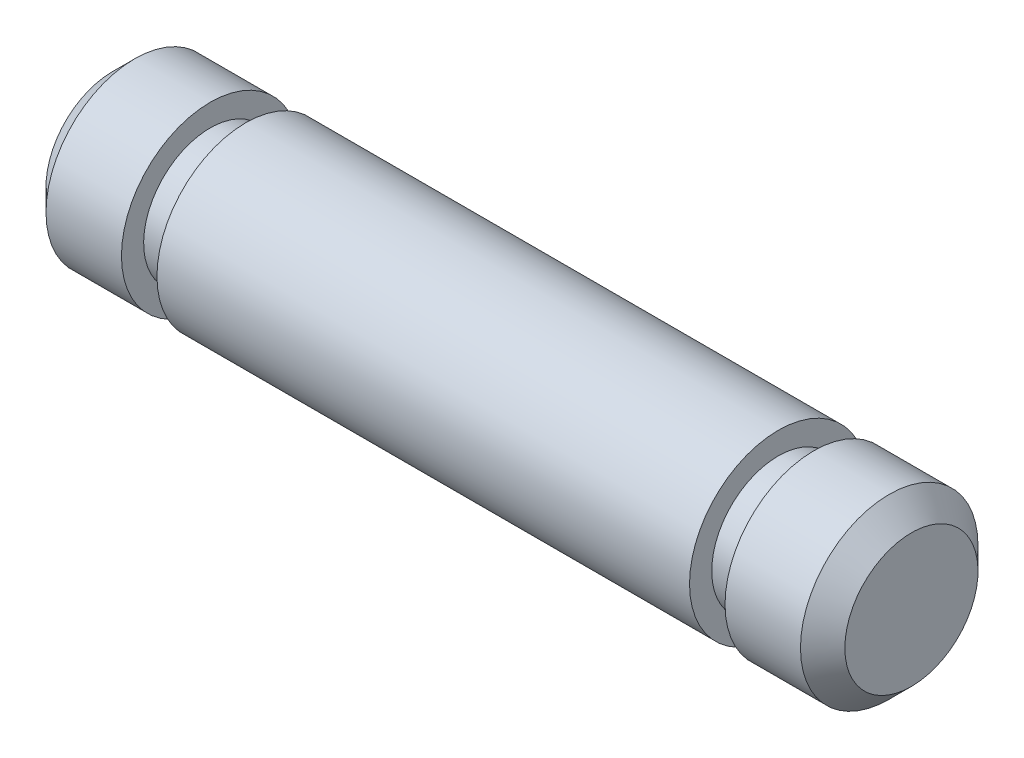
ISO-10303-21;
HEADER;
FILE_DESCRIPTION(('STEP AP214'),'2;1');
FILE_NAME('part.step','',(''),(''),'','','');
FILE_SCHEMA(('AUTOMOTIVE_DESIGN { 1 0 10303 214 1 1 1 1 }'));
ENDSEC;
DATA;
#1=APPLICATION_CONTEXT('core data for automotive mechanical design processes');
#2=APPLICATION_PROTOCOL_DEFINITION('international standard','automotive_design',2000,#1);
#3=PRODUCT_CONTEXT('',#1,'mechanical');
#4=PRODUCT('Part','Part','',(#3));
#5=PRODUCT_RELATED_PRODUCT_CATEGORY('part','',(#4));
#6=PRODUCT_DEFINITION_FORMATION('','',#4);
#7=PRODUCT_DEFINITION_CONTEXT('part definition',#1,'design');
#8=PRODUCT_DEFINITION('design','',#6,#7);
#9=PRODUCT_DEFINITION_SHAPE('','',#8);
#10=(LENGTH_UNIT() NAMED_UNIT(*) SI_UNIT(.MILLI.,.METRE.));
#11=(NAMED_UNIT(*) PLANE_ANGLE_UNIT() SI_UNIT($,.RADIAN.));
#12=(NAMED_UNIT(*) SI_UNIT($,.STERADIAN.) SOLID_ANGLE_UNIT());
#13=UNCERTAINTY_MEASURE_WITH_UNIT(LENGTH_MEASURE(1.E-05),#10,'distance_accuracy_value','');
#14=(GEOMETRIC_REPRESENTATION_CONTEXT(3) GLOBAL_UNCERTAINTY_ASSIGNED_CONTEXT((#13)) GLOBAL_UNIT_ASSIGNED_CONTEXT((#10,
#11,#12)) REPRESENTATION_CONTEXT('',''));
#15=CARTESIAN_POINT('',(0.,0.,0.));
#16=DIRECTION('',(0.,0.,1.));
#17=DIRECTION('',(1.,0.,0.));
#18=AXIS2_PLACEMENT_3D('',#15,#16,#17);
#19=CARTESIAN_POINT('',(18.,2.,0.));
#20=DIRECTION('',(1.,0.,0.));
#21=DIRECTION('',(0.,1.,0.));
#22=AXIS2_PLACEMENT_3D('',#19,#20,#21);
#23=CYLINDRICAL_SURFACE('',#22,2.);
#24=CARTESIAN_POINT('',(3.,2.,0.));
#25=DIRECTION('',(-1.,0.,0.));
#26=DIRECTION('',(0.,-1.,0.));
#27=AXIS2_PLACEMENT_3D('',#24,#25,#26);
#28=CIRCLE('',#27,2.);
#29=CARTESIAN_POINT('',(3.,0.,0.));
#30=VERTEX_POINT('',#29);
#31=EDGE_CURVE('E61',#30,#30,#28,.T.);
#32=ORIENTED_EDGE('',*,*,#31,.F.);
#33=EDGE_LOOP('',(#32));
#34=FACE_BOUND('',#33,.T.);
#35=CARTESIAN_POINT('',(15.,2.,0.));
#36=DIRECTION('',(1.,0.,0.));
#37=DIRECTION('',(0.,1.,0.));
#38=AXIS2_PLACEMENT_3D('',#35,#36,#37);
#39=CIRCLE('',#38,2.);
#40=CARTESIAN_POINT('',(15.,4.,0.));
#41=VERTEX_POINT('',#40);
#42=EDGE_CURVE('E73',#41,#41,#39,.T.);
#43=ORIENTED_EDGE('',*,*,#42,.F.);
#44=EDGE_LOOP('',(#43));
#45=FACE_BOUND('',#44,.T.);
#46=ADVANCED_FACE('F39',(#34,#45),#23,.T.);
#47=CARTESIAN_POINT('',(0.,2.,0.));
#48=DIRECTION('',(1.,0.,0.));
#49=DIRECTION('',(0.,1.,0.));
#50=AXIS2_PLACEMENT_3D('',#47,#48,#49);
#51=PLANE('',#50);
#52=CARTESIAN_POINT('',(0.,2.,0.));
#53=DIRECTION('',(1.,0.,0.));
#54=DIRECTION('',(0.,1.,0.));
#55=AXIS2_PLACEMENT_3D('',#52,#53,#54);
#56=CIRCLE('',#55,1.49999999999999);
#57=CARTESIAN_POINT('',(0.,3.49999999999999,0.));
#58=VERTEX_POINT('',#57);
#59=EDGE_CURVE('E51',#58,#58,#56,.F.);
#60=ORIENTED_EDGE('',*,*,#59,.T.);
#61=EDGE_LOOP('',(#60));
#62=FACE_BOUND('',#61,.T.);
#63=ADVANCED_FACE('F106',(#62),#51,.F.);
#64=CARTESIAN_POINT('',(0.500000000000004,2.,0.));
#65=DIRECTION('',(1.,0.,0.));
#66=DIRECTION('',(0.,0.,-1.));
#67=AXIS2_PLACEMENT_3D('',#64,#65,#66);
#68=CIRCLE('',#67,2.);
#69=CARTESIAN_POINT('',(0.500000000000004,2.,-2.));
#70=VERTEX_POINT('',#69);
#71=EDGE_CURVE('E55',#70,#70,#68,.T.);
#72=ORIENTED_EDGE('',*,*,#71,.T.);
#73=EDGE_LOOP('',(#72));
#74=FACE_BOUND('',#73,.T.);
#75=CARTESIAN_POINT('',(2.2,2.,0.));
#76=DIRECTION('',(-1.,0.,0.));
#77=DIRECTION('',(0.,-1.,0.));
#78=AXIS2_PLACEMENT_3D('',#75,#76,#77);
#79=CIRCLE('',#78,2.);
#80=CARTESIAN_POINT('',(2.2,0.,0.));
#81=VERTEX_POINT('',#80);
#82=EDGE_CURVE('E60',#81,#81,#79,.T.);
#83=ORIENTED_EDGE('',*,*,#82,.T.);
#84=EDGE_LOOP('',(#83));
#85=FACE_BOUND('',#84,.T.);
#86=ADVANCED_FACE('F110',(#74,#85),#23,.T.);
#87=CARTESIAN_POINT('',(2.2,2.,0.));
#88=DIRECTION('',(-1.,0.,0.));
#89=DIRECTION('',(0.,-1.,0.));
#90=AXIS2_PLACEMENT_3D('',#87,#88,#89);
#91=PLANE('',#90);
#92=ORIENTED_EDGE('',*,*,#82,.F.);
#93=EDGE_LOOP('',(#92));
#94=FACE_BOUND('',#93,.T.);
#95=CARTESIAN_POINT('',(2.2,2.,0.));
#96=DIRECTION('',(-1.,0.,0.));
#97=DIRECTION('',(0.,-1.,0.));
#98=AXIS2_PLACEMENT_3D('',#95,#96,#97);
#99=CIRCLE('',#98,1.5);
#100=CARTESIAN_POINT('',(2.2,0.499999999999998,0.));
#101=VERTEX_POINT('',#100);
#102=EDGE_CURVE('E64',#101,#101,#99,.T.);
#103=ORIENTED_EDGE('',*,*,#102,.T.);
#104=EDGE_LOOP('',(#103));
#105=FACE_BOUND('',#104,.T.);
#106=ADVANCED_FACE('F123',(#94,#105),#91,.F.);
#107=CARTESIAN_POINT('',(3.,2.,0.));
#108=DIRECTION('',(-1.,0.,0.));
#109=DIRECTION('',(0.,-1.,0.));
#110=AXIS2_PLACEMENT_3D('',#107,#108,#109);
#111=PLANE('',#110);
#112=ORIENTED_EDGE('',*,*,#31,.T.);
#113=EDGE_LOOP('',(#112));
#114=FACE_BOUND('',#113,.T.);
#115=CARTESIAN_POINT('',(3.,2.,0.));
#116=DIRECTION('',(-1.,0.,0.));
#117=DIRECTION('',(0.,-1.,0.));
#118=AXIS2_PLACEMENT_3D('',#115,#116,#117);
#119=CIRCLE('',#118,1.5);
#120=CARTESIAN_POINT('',(3.,0.499999999999998,0.));
#121=VERTEX_POINT('',#120);
#122=EDGE_CURVE('E67',#121,#121,#119,.T.);
#123=ORIENTED_EDGE('',*,*,#122,.F.);
#124=EDGE_LOOP('',(#123));
#125=FACE_BOUND('',#124,.T.);
#126=ADVANCED_FACE('F129',(#114,#125),#111,.T.);
#127=CARTESIAN_POINT('',(2.2,2.,0.));
#128=DIRECTION('',(1.,0.,0.));
#129=DIRECTION('',(0.,1.,0.));
#130=AXIS2_PLACEMENT_3D('',#127,#128,#129);
#131=CYLINDRICAL_SURFACE('',#130,1.5);
#132=ORIENTED_EDGE('',*,*,#102,.F.);
#133=EDGE_LOOP('',(#132));
#134=FACE_BOUND('',#133,.T.);
#135=ORIENTED_EDGE('',*,*,#122,.T.);
#136=EDGE_LOOP('',(#135));
#137=FACE_BOUND('',#136,.T.);
#138=ADVANCED_FACE('F101',(#134,#137),#131,.T.);
#139=CARTESIAN_POINT('',(15.8,2.,0.));
#140=DIRECTION('',(1.,0.,0.));
#141=DIRECTION('',(0.,1.,0.));
#142=AXIS2_PLACEMENT_3D('',#139,#140,#141);
#143=PLANE('',#142);
#144=CARTESIAN_POINT('',(15.8,2.,0.));
#145=DIRECTION('',(1.,0.,0.));
#146=DIRECTION('',(0.,1.,0.));
#147=AXIS2_PLACEMENT_3D('',#144,#145,#146);
#148=CIRCLE('',#147,2.);
#149=CARTESIAN_POINT('',(15.8,4.,0.));
#150=VERTEX_POINT('',#149);
#151=EDGE_CURVE('E70',#150,#150,#148,.T.);
#152=ORIENTED_EDGE('',*,*,#151,.F.);
#153=EDGE_LOOP('',(#152));
#154=FACE_BOUND('',#153,.T.);
#155=CARTESIAN_POINT('',(15.8,2.,0.));
#156=DIRECTION('',(1.,0.,0.));
#157=DIRECTION('',(0.,1.,0.));
#158=AXIS2_PLACEMENT_3D('',#155,#156,#157);
#159=CIRCLE('',#158,1.5);
#160=CARTESIAN_POINT('',(15.8,3.5,0.));
#161=VERTEX_POINT('',#160);
#162=EDGE_CURVE('E76',#161,#161,#159,.T.);
#163=ORIENTED_EDGE('',*,*,#162,.T.);
#164=EDGE_LOOP('',(#163));
#165=FACE_BOUND('',#164,.T.);
#166=ADVANCED_FACE('F85',(#154,#165),#143,.F.);
#167=CARTESIAN_POINT('',(15.,2.,0.));
#168=DIRECTION('',(1.,0.,0.));
#169=DIRECTION('',(0.,1.,0.));
#170=AXIS2_PLACEMENT_3D('',#167,#168,#169);
#171=PLANE('',#170);
#172=ORIENTED_EDGE('',*,*,#42,.T.);
#173=EDGE_LOOP('',(#172));
#174=FACE_BOUND('',#173,.T.);
#175=CARTESIAN_POINT('',(15.,2.,0.));
#176=DIRECTION('',(1.,0.,0.));
#177=DIRECTION('',(0.,1.,0.));
#178=AXIS2_PLACEMENT_3D('',#175,#176,#177);
#179=CIRCLE('',#178,1.5);
#180=CARTESIAN_POINT('',(15.,3.5,0.));
#181=VERTEX_POINT('',#180);
#182=EDGE_CURVE('E79',#181,#181,#179,.T.);
#183=ORIENTED_EDGE('',*,*,#182,.F.);
#184=EDGE_LOOP('',(#183));
#185=FACE_BOUND('',#184,.T.);
#186=ADVANCED_FACE('F91',(#174,#185),#171,.T.);
#187=CARTESIAN_POINT('',(15.8,2.,0.));
#188=DIRECTION('',(-1.,0.,0.));
#189=DIRECTION('',(0.,-1.,0.));
#190=AXIS2_PLACEMENT_3D('',#187,#188,#189);
#191=CYLINDRICAL_SURFACE('',#190,1.5);
#192=ORIENTED_EDGE('',*,*,#162,.F.);
#193=EDGE_LOOP('',(#192));
#194=FACE_BOUND('',#193,.T.);
#195=ORIENTED_EDGE('',*,*,#182,.T.);
#196=EDGE_LOOP('',(#195));
#197=FACE_BOUND('',#196,.T.);
#198=ADVANCED_FACE('F87',(#194,#197),#191,.T.);
#199=CARTESIAN_POINT('',(18.,0.,0.));
#200=DIRECTION('',(-1.,0.,0.));
#201=DIRECTION('',(0.,-1.,0.));
#202=AXIS2_PLACEMENT_3D('',#199,#200,#201);
#203=PLANE('',#202);
#204=CARTESIAN_POINT('',(18.,2.,0.));
#205=DIRECTION('',(-1.,0.,0.));
#206=DIRECTION('',(0.,-1.,0.));
#207=AXIS2_PLACEMENT_3D('',#204,#205,#206);
#208=CIRCLE('',#207,1.5);
#209=CARTESIAN_POINT('',(18.,0.5,0.));
#210=VERTEX_POINT('',#209);
#211=EDGE_CURVE('E47',#210,#210,#208,.F.);
#212=ORIENTED_EDGE('',*,*,#211,.T.);
#213=EDGE_LOOP('',(#212));
#214=FACE_BOUND('',#213,.T.);
#215=ADVANCED_FACE('F90',(#214),#203,.F.);
#216=CARTESIAN_POINT('',(17.5,2.,0.));
#217=DIRECTION('',(-1.,0.,0.));
#218=DIRECTION('',(0.,0.,1.));
#219=AXIS2_PLACEMENT_3D('',#216,#217,#218);
#220=CIRCLE('',#219,2.);
#221=CARTESIAN_POINT('',(17.5,2.,2.));
#222=VERTEX_POINT('',#221);
#223=EDGE_CURVE('E10',#222,#222,#220,.T.);
#224=ORIENTED_EDGE('',*,*,#223,.T.);
#225=EDGE_LOOP('',(#224));
#226=FACE_BOUND('',#225,.T.);
#227=ORIENTED_EDGE('',*,*,#151,.T.);
#228=EDGE_LOOP('',(#227));
#229=FACE_BOUND('',#228,.T.);
#230=ADVANCED_FACE('F109',(#226,#229),#23,.T.);
#231=CARTESIAN_POINT('',(0.500000000000004,2.,0.));
#232=DIRECTION('',(1.,0.,0.));
#233=DIRECTION('',(0.,0.,-1.));
#234=AXIS2_PLACEMENT_3D('',#231,#232,#233);
#235=CONICAL_SURFACE('',#234,2.,0.785398163397452);
#236=ORIENTED_EDGE('',*,*,#59,.F.);
#237=EDGE_LOOP('',(#236));
#238=FACE_BOUND('',#237,.T.);
#239=ORIENTED_EDGE('',*,*,#71,.F.);
#240=EDGE_LOOP('',(#239));
#241=FACE_BOUND('',#240,.T.);
#242=ADVANCED_FACE('F121',(#238,#241),#235,.T.);
#243=CARTESIAN_POINT('',(18.,2.,0.));
#244=DIRECTION('',(-1.,0.,0.));
#245=DIRECTION('',(0.,0.,1.));
#246=AXIS2_PLACEMENT_3D('',#243,#244,#245);
#247=CONICAL_SURFACE('',#246,1.5,0.785398163397448);
#248=ORIENTED_EDGE('',*,*,#223,.F.);
#249=EDGE_LOOP('',(#248));
#250=FACE_BOUND('',#249,.T.);
#251=ORIENTED_EDGE('',*,*,#211,.F.);
#252=EDGE_LOOP('',(#251));
#253=FACE_BOUND('',#252,.T.);
#254=ADVANCED_FACE('F42',(#250,#253),#247,.T.);
#255=CLOSED_SHELL('',(#46,#63,#86,#106,#126,#138,#166,#186,#198,#215,#230,#242,#254));
#256=MANIFOLD_SOLID_BREP('B2',#255);
#257=ADVANCED_BREP_SHAPE_REPRESENTATION('',(#18,#256),#14);
#258=SHAPE_DEFINITION_REPRESENTATION(#9,#257);
ENDSEC;
END-ISO-10303-21;
